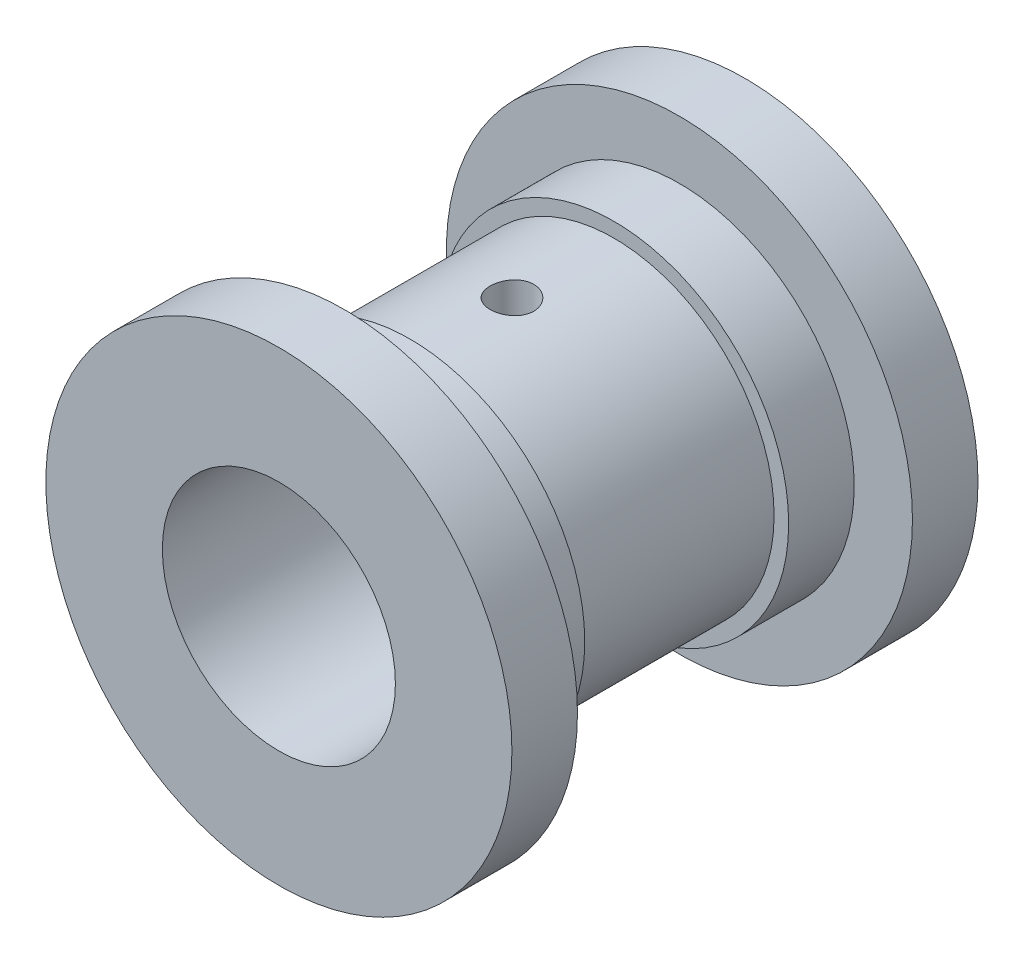
ISO-10303-21;
HEADER;
FILE_DESCRIPTION(('STEP AP214'),'2;1');
FILE_NAME('part.step','',(''),(''),'','','');
FILE_SCHEMA(('AUTOMOTIVE_DESIGN { 1 0 10303 214 1 1 1 1 }'));
ENDSEC;
DATA;
#1=APPLICATION_CONTEXT('core data for automotive mechanical design processes');
#2=APPLICATION_PROTOCOL_DEFINITION('international standard','automotive_design',2000,#1);
#3=PRODUCT_CONTEXT('',#1,'mechanical');
#4=PRODUCT('Part','Part','',(#3));
#5=PRODUCT_RELATED_PRODUCT_CATEGORY('part','',(#4));
#6=PRODUCT_DEFINITION_FORMATION('','',#4);
#7=PRODUCT_DEFINITION_CONTEXT('part definition',#1,'design');
#8=PRODUCT_DEFINITION('design','',#6,#7);
#9=PRODUCT_DEFINITION_SHAPE('','',#8);
#10=(LENGTH_UNIT() NAMED_UNIT(*) SI_UNIT(.MILLI.,.METRE.));
#11=(NAMED_UNIT(*) PLANE_ANGLE_UNIT() SI_UNIT($,.RADIAN.));
#12=(NAMED_UNIT(*) SI_UNIT($,.STERADIAN.) SOLID_ANGLE_UNIT());
#13=UNCERTAINTY_MEASURE_WITH_UNIT(LENGTH_MEASURE(1.E-05),#10,'distance_accuracy_value','');
#14=(GEOMETRIC_REPRESENTATION_CONTEXT(3) GLOBAL_UNCERTAINTY_ASSIGNED_CONTEXT((#13)) GLOBAL_UNIT_ASSIGNED_CONTEXT((#10,
#11,#12)) REPRESENTATION_CONTEXT('',''));
#15=CARTESIAN_POINT('',(0.,0.,0.));
#16=DIRECTION('',(0.,0.,1.));
#17=DIRECTION('',(1.,0.,0.));
#18=AXIS2_PLACEMENT_3D('',#15,#16,#17);
#19=CARTESIAN_POINT('',(0.,0.,14.));
#20=DIRECTION('',(0.,0.,-1.));
#21=DIRECTION('',(-1.,0.,0.));
#22=AXIS2_PLACEMENT_3D('',#19,#20,#21);
#23=CYLINDRICAL_SURFACE('',#22,22.);
#24=CARTESIAN_POINT('',(0.,22.,-3.));
#25=CARTESIAN_POINT('',(0.167676826859721,21.9999974934523,-2.99999296108524));
#26=CARTESIAN_POINT('',(0.335455204579492,21.9980628542975,-2.98589481465488));
#27=CARTESIAN_POINT('',(0.666334195282824,21.990531328169,-2.92988223355143));
#28=CARTESIAN_POINT('',(0.829429891319714,21.984930728802,-2.88793960110033));
#29=CARTESIAN_POINT('',(1.14610618738719,21.9706975479658,-2.77750453231876));
#30=CARTESIAN_POINT('',(1.29969344490645,21.9620671167838,-2.70903092159583));
#31=CARTESIAN_POINT('',(1.59317060489946,21.9427314544459,-2.54752095087958));
#32=CARTESIAN_POINT('',(1.73306265771744,21.9320265498011,-2.45448845549142));
#33=CARTESIAN_POINT('',(1.99611512762449,21.9096571993851,-2.24585557141538));
#34=CARTESIAN_POINT('',(2.11917356924753,21.8979875381044,-2.13012715399307));
#35=CARTESIAN_POINT('',(2.34418667816088,21.8750454311864,-1.87966277841522));
#36=CARTESIAN_POINT('',(2.44614021225599,21.863773006905,-1.74492580027736));
#37=CARTESIAN_POINT('',(2.62643701049846,21.8428507554376,-1.45959612355178));
#38=CARTESIAN_POINT('',(2.70468332936807,21.833207660216,-1.30894162998957));
#39=CARTESIAN_POINT('',(2.83472528970555,21.8167058813552,-0.996476369252653));
#40=CARTESIAN_POINT('',(2.8865221221597,21.8098470723459,-0.834666104780393));
#41=CARTESIAN_POINT('',(2.9618818111018,21.7997409938434,-0.505547512852815));
#42=CARTESIAN_POINT('',(2.98561797729098,21.7964715644898,-0.338279561417878));
#43=CARTESIAN_POINT('',(3.00471910119333,21.7938468760964,-0.00210505395184277));
#44=CARTESIAN_POINT('',(3.00008540995952,21.7944914306616,0.166801423665521));
#45=CARTESIAN_POINT('',(2.9627203403848,21.7996016067311,0.500243451201806));
#46=CARTESIAN_POINT('',(2.9301807783518,21.8040411420393,0.66480095273435));
#47=CARTESIAN_POINT('',(2.83822735390599,21.8162003481636,0.986098081065302));
#48=CARTESIAN_POINT('',(2.77881285300506,21.8239200969101,1.14283752202593));
#49=CARTESIAN_POINT('',(2.63459283520415,21.841799165874,1.44463985207525));
#50=CARTESIAN_POINT('',(2.54970487715522,21.851966385515,1.58966285853603));
#51=CARTESIAN_POINT('',(2.35700646089641,21.8735888866938,1.86347829777156));
#52=CARTESIAN_POINT('',(2.24919475646083,21.8850442382436,1.99226984753348));
#53=CARTESIAN_POINT('',(2.01265055567599,21.908067947796,2.23107910898916));
#54=CARTESIAN_POINT('',(1.88375290146846,21.9196364588217,2.34093328062486));
#55=CARTESIAN_POINT('',(1.60926188881082,21.9414949411558,2.53747298319676));
#56=CARTESIAN_POINT('',(1.46366847832928,21.9517849084796,2.62415844192609));
#57=CARTESIAN_POINT('',(1.1597859389609,21.9699350817542,2.77190372636007));
#58=CARTESIAN_POINT('',(1.00149126426258,21.9777942189694,2.83295228478543));
#59=CARTESIAN_POINT('',(0.676766175879787,21.9901879040614,2.92755567589119));
#60=CARTESIAN_POINT('',(0.510336216560259,21.994722637384,2.96111204218697));
#61=CARTESIAN_POINT('',(0.175477814735345,21.9999322760751,2.99956416913117));
#62=CARTESIAN_POINT('',(0.00707567277568732,22.0006374938028,3.00468501717721));
#63=CARTESIAN_POINT('',(-0.328184588178507,21.9981907754197,2.98671624333853));
#64=CARTESIAN_POINT('',(-0.495042746360837,21.9950389374767,2.96362733943417));
#65=CARTESIAN_POINT('',(-0.821806756729892,21.9852510531583,2.89008155358068));
#66=CARTESIAN_POINT('',(-0.981737441241117,21.9786288024664,2.83973300885735));
#67=CARTESIAN_POINT('',(-1.29088628219117,21.9626408812727,2.71321048193417));
#68=CARTESIAN_POINT('',(-1.44010401285043,21.9532751018062,2.63703547396566));
#69=CARTESIAN_POINT('',(-1.72458978596492,21.9327672607206,2.46048492255194));
#70=CARTESIAN_POINT('',(-1.85976745670649,21.921614741142,2.35996499439926));
#71=CARTESIAN_POINT('',(-2.11141402650921,21.8988110628535,2.1377808440853));
#72=CARTESIAN_POINT('',(-2.22788203490664,21.8871598804385,2.01611561588667));
#73=CARTESIAN_POINT('',(-2.43961065908225,21.8645773754606,1.75409833398319));
#74=CARTESIAN_POINT('',(-2.53472132761283,21.8536515002427,1.61362457303786));
#75=CARTESIAN_POINT('',(-2.69999679098531,21.8338493008832,1.31856338460047));
#76=CARTESIAN_POINT('',(-2.77016216392283,21.8249729292469,1.16397628428285));
#77=CARTESIAN_POINT('',(-2.88331699010305,21.8103129452134,0.845544486653621));
#78=CARTESIAN_POINT('',(-2.92638854100027,21.8045199979441,0.681729411127736));
#79=CARTESIAN_POINT('',(-2.98439621095037,21.7966568632046,0.349106956343931));
#80=CARTESIAN_POINT('',(-2.99933390995801,21.7945864666819,0.180299857971297));
#81=CARTESIAN_POINT('',(-3.00061713169436,21.7944097083055,-0.15602195078192));
#82=CARTESIAN_POINT('',(-2.98719829381274,21.796270677241,-0.323535793216798));
#83=CARTESIAN_POINT('',(-2.93265092877067,21.8036764010729,-0.653902277396974));
#84=CARTESIAN_POINT('',(-2.89152241742378,21.809221153867,-0.816754921802306));
#85=CARTESIAN_POINT('',(-2.7828011290096,21.8233590163958,-1.13313027877028));
#86=CARTESIAN_POINT('',(-2.71522193961382,21.8319505607859,-1.28665773496507));
#87=CARTESIAN_POINT('',(-2.55554079678239,21.85121622249,-1.58023259721272));
#88=CARTESIAN_POINT('',(-2.46343830731648,21.8618903853246,-1.7202797085211));
#89=CARTESIAN_POINT('',(-2.25645830446166,21.884224598437,-1.98412007319957));
#90=CARTESIAN_POINT('',(-2.14140556846805,21.8958918112072,-2.10777527244502));
#91=CARTESIAN_POINT('',(-1.89215973610724,21.9188357460712,-2.33411069342156));
#92=CARTESIAN_POINT('',(-1.7579621639157,21.9301123760831,-2.43678599662273));
#93=CARTESIAN_POINT('',(-1.473530986404,21.9510618593984,-2.61865193476672));
#94=CARTESIAN_POINT('',(-1.32322763703472,21.9607272329125,-2.69773431655265));
#95=CARTESIAN_POINT('',(-1.01141938786063,21.9772907411432,-2.82941896210595));
#96=CARTESIAN_POINT('',(-0.849926624043753,21.9841918205545,-2.8820494193874));
#97=CARTESIAN_POINT('',(-0.573037194174379,21.9928235213462,-2.94702087412789));
#98=CARTESIAN_POINT('',(-0.459371577392146,21.9955012855773,-2.96685872159469));
#99=CARTESIAN_POINT('',(-0.230486627293774,21.9990903781477,-2.99335064196243));
#100=CARTESIAN_POINT('',(-0.1152673085954,22.0000017230944,-3.0000048388127));
#101=CARTESIAN_POINT('',(0.,22.,-3.));
#102=B_SPLINE_CURVE_WITH_KNOTS('',3,(#24,#25,#26,#27,#28,#29,#30,#31,#32,#33,#34,#35,#36,#37,
#38,#39,#40,#41,#42,#43,#44,#45,#46,#47,#48,#49,#50,#51,#52,#53,#54,#55,#56,#57,#58,#59,#60,#61,
#62,#63,#64,#65,#66,#67,#68,#69,#70,#71,#72,#73,#74,#75,#76,#77,#78,#79,#80,#81,#82,#83,#84,#85,
#86,#87,#88,#89,#90,#91,#92,#93,#94,#95,#96,#97,#98,#99,#100,#101),.UNSPECIFIED.,.T.,.F.,(4,2,2,
2,2,2,2,2,2,2,2,2,2,2,2,2,2,2,2,2,2,2,2,2,2,2,2,2,2,2,2,2,2,2,2,2,2,2,4),(0.,0.502609376172301,
1.00572851685898,1.50849131075064,2.0111750366105,2.51678051739006,3.02241313883223,
3.53008635854344,4.03773671636778,4.54223504001235,5.04670933820383,5.54774357745448,
6.04878972077749,6.55147524370068,7.05418810159109,7.56104569493679,8.06790486792019,
8.57498657022924,9.08203998373342,9.58507392409649,10.0880950617602,10.5891315761909,
11.0901879929896,11.5942921539578,12.0984203054351,12.6059843025882,13.1135365364146,
13.619543320099,14.1255216863572,14.6273119749012,15.1291019770798,15.6306345481248,
16.1321780825684,16.6377084708874,17.1433572401882,17.6512916404935,18.1586835098852,
18.5041992012525,18.8497116441535),.UNSPECIFIED.);
#103=CARTESIAN_POINT('',(0.,22.,-3.));
#104=VERTEX_POINT('',#103);
#105=EDGE_CURVE('E155',#104,#104,#102,.T.);
#106=ORIENTED_EDGE('',*,*,#105,.T.);
#107=EDGE_LOOP('',(#106));
#108=FACE_BOUND('',#107,.T.);
#109=CARTESIAN_POINT('',(0.,-22.,4.));
#110=CARTESIAN_POINT('',(0.222714543288746,-21.9999960145572,3.99999136267864));
#111=CARTESIAN_POINT('',(0.445542899836405,-21.9965830546687,3.9813364850347));
#112=CARTESIAN_POINT('',(0.884928813696618,-21.9832969500399,3.90725306795016));
#113=CARTESIAN_POINT('',(1.10148077453215,-21.9734182144508,3.85179270283726));
#114=CARTESIAN_POINT('',(1.52189514502749,-21.9483064647013,3.70584574065803));
#115=CARTESIAN_POINT('',(1.72576852786035,-21.9330781586384,3.61538993562047));
#116=CARTESIAN_POINT('',(2.115424006769,-21.898933429966,3.40210533761642));
#117=CARTESIAN_POINT('',(2.30120773535809,-21.8800173406264,3.27927946962361));
#118=CARTESIAN_POINT('',(2.65152888102477,-21.8403486699966,3.00326818071459));
#119=CARTESIAN_POINT('',(2.81583245206691,-21.8195794519416,2.84978831603848));
#120=CARTESIAN_POINT('',(3.11650714682158,-21.7786699042361,2.51745929182035));
#121=CARTESIAN_POINT('',(3.25287633589955,-21.7585296182252,2.3386083766217));
#122=CARTESIAN_POINT('',(3.49477390032954,-21.7209968041953,1.95897454108045));
#123=CARTESIAN_POINT('',(3.60006626531112,-21.703625742202,1.75803892953925));
#124=CARTESIAN_POINT('',(3.77531093899957,-21.673831665538,1.34096269935207));
#125=CARTESIAN_POINT('',(3.8452661056655,-21.6614082507349,1.12482331194992));
#126=CARTESIAN_POINT('',(3.9471039542263,-21.6430830703341,0.685970701286804));
#127=CARTESIAN_POINT('',(3.97939332850889,-21.6371116924469,0.46335481658075));
#128=CARTESIAN_POINT('',(4.00624497473377,-21.6321566286462,0.0157911853708643));
#129=CARTESIAN_POINT('',(4.00081042593285,-21.633172353881,-0.209156363032063));
#130=CARTESIAN_POINT('',(3.95269868854,-21.6420133009836,-0.652063828266035));
#131=CARTESIAN_POINT('',(3.91048235398144,-21.6497542562853,-0.870075735791443));
#132=CARTESIAN_POINT('',(3.79073046680053,-21.6710412254782,-1.29587003673433));
#133=CARTESIAN_POINT('',(3.71319349486376,-21.6845874726464,-1.50365201870358));
#134=CARTESIAN_POINT('',(3.52454595578591,-21.7160476310543,-1.90444558155747));
#135=CARTESIAN_POINT('',(3.41324780743079,-21.733985834287,-2.09736688533225));
#136=CARTESIAN_POINT('',(3.16037006748085,-21.7721924402343,-2.46196947389059));
#137=CARTESIAN_POINT('',(3.01878758047169,-21.7924610656694,-2.63364872529248));
#138=CARTESIAN_POINT('',(2.70686798836704,-21.8334128161709,-2.95355799288875));
#139=CARTESIAN_POINT('',(2.53613634531379,-21.8540976363293,-3.10140337687383));
#140=CARTESIAN_POINT('',(2.17208908138662,-21.8932750087418,-3.36641026696166));
#141=CARTESIAN_POINT('',(1.97877325899631,-21.9117675414312,-3.48357149924253));
#142=CARTESIAN_POINT('',(1.57465519699459,-21.9445107565068,-3.68393477957005));
#143=CARTESIAN_POINT('',(1.36383356079098,-21.9587566511844,-3.76709853739196));
#144=CARTESIAN_POINT('',(0.930896828925332,-21.9813641094176,-3.89672638498741));
#145=CARTESIAN_POINT('',(0.708782862632129,-21.9897262601819,-3.94319413714782));
#146=CARTESIAN_POINT('',(0.262877299156998,-21.9995438675732,-3.99757952383824));
#147=CARTESIAN_POINT('',(0.0391520242178683,-22.0010937868229,-4.00602444690816));
#148=CARTESIAN_POINT('',(-0.406514477941934,-21.99737260495,-3.98553640363702));
#149=CARTESIAN_POINT('',(-0.628455786906163,-21.9921018181742,-3.95660515985652));
#150=CARTESIAN_POINT('',(-1.06259419518552,-21.975390172649,-3.86262450087624));
#151=CARTESIAN_POINT('',(-1.27485059491664,-21.9639946314432,-3.79784026163435));
#152=CARTESIAN_POINT('',(-1.68548942751322,-21.9363059024444,-3.63427834295612));
#153=CARTESIAN_POINT('',(-1.8838709619219,-21.9200123978487,-3.5354984646046));
#154=CARTESIAN_POINT('',(-2.26339049414987,-21.8840995916968,-3.30557072439415));
#155=CARTESIAN_POINT('',(-2.44432890416976,-21.864447632292,-3.17409862568815));
#156=CARTESIAN_POINT('',(-2.78176427644694,-21.8240857614217,-2.88295924665781));
#157=CARTESIAN_POINT('',(-2.93825909948664,-21.8033757575701,-2.72328950117612));
#158=CARTESIAN_POINT('',(-3.22435475775359,-21.7629207911529,-2.37790623710301));
#159=CARTESIAN_POINT('',(-3.35359673482837,-21.7431910424377,-2.19189338694827));
#160=CARTESIAN_POINT('',(-3.57899973104027,-21.7072302016204,-1.80048763718703));
#161=CARTESIAN_POINT('',(-3.6751619326159,-21.6909989844708,-1.59509543063123));
#162=CARTESIAN_POINT('',(-3.83115890483493,-21.6639908923095,-1.17169850061651));
#163=CARTESIAN_POINT('',(-3.8911621572368,-21.653188760335,-0.953757538523891));
#164=CARTESIAN_POINT('',(-3.97366080357107,-21.6382025309078,-0.510674022737863));
#165=CARTESIAN_POINT('',(-3.99616014907258,-21.6340177362272,-0.285532230302156));
#166=CARTESIAN_POINT('',(-4.00288627326368,-21.6327738776523,0.161970750927272));
#167=CARTESIAN_POINT('',(-3.98767874002465,-21.6356094908823,0.384323342877082));
#168=CARTESIAN_POINT('',(-3.92065693825629,-21.6478541749405,0.823247276034827));
#169=CARTESIAN_POINT('',(-3.86884285811435,-21.6572632119402,1.03981864698857));
#170=CARTESIAN_POINT('',(-3.73031134316953,-21.6815514416183,1.46075239479074));
#171=CARTESIAN_POINT('',(-3.64365162038464,-21.6964215859949,1.66513432044686));
#172=CARTESIAN_POINT('',(-3.43794947329646,-21.7299635502969,2.05654889432947));
#173=CARTESIAN_POINT('',(-3.31890495138014,-21.7486356164588,2.24358041769117));
#174=CARTESIAN_POINT('',(-3.04983087325598,-21.7880064930293,2.59782574919125));
#175=CARTESIAN_POINT('',(-2.89938831106199,-21.8087301566221,2.76472313974153));
#176=CARTESIAN_POINT('',(-2.57265302846728,-21.849679841373,3.07109416202438));
#177=CARTESIAN_POINT('',(-2.39635437360186,-21.8699057470383,3.21056148078449));
#178=CARTESIAN_POINT('',(-2.0211423792926,-21.9077794859438,3.45920059424698));
#179=CARTESIAN_POINT('',(-1.82205169958099,-21.9254042634686,3.56810837036026));
#180=CARTESIAN_POINT('',(-1.40814781017269,-21.9558652198669,3.75075843214811));
#181=CARTESIAN_POINT('',(-1.19334985097334,-21.9687059716947,3.82453431855663));
#182=CARTESIAN_POINT('',(-0.814883498916811,-21.9854814075298,3.91955086060438));
#183=CARTESIAN_POINT('',(-0.65345085455298,-21.9908956054717,3.9496686659207));
#184=CARTESIAN_POINT('',(-0.328032684264407,-21.9981563286609,3.9898961875898));
#185=CARTESIAN_POINT('',(-0.164047216881666,-22.0000029356,4.00000636208354));
#186=CARTESIAN_POINT('',(0.,-22.,4.));
#187=B_SPLINE_CURVE_WITH_KNOTS('',3,(#109,#110,#111,#112,#113,#114,#115,#116,#117,#118,#119,
#120,#121,#122,#123,#124,#125,#126,#127,#128,#129,#130,#131,#132,#133,#134,#135,#136,#137,#138,
#139,#140,#141,#142,#143,#144,#145,#146,#147,#148,#149,#150,#151,#152,#153,#154,#155,#156,#157,
#158,#159,#160,#161,#162,#163,#164,#165,#166,#167,#168,#169,#170,#171,#172,#173,#174,#175,#176,
#177,#178,#179,#180,#181,#182,#183,#184,#185,#186),.UNSPECIFIED.,.T.,.F.,(4,2,2,2,2,2,2,2,2,2,2,
2,2,2,2,2,2,2,2,2,2,2,2,2,2,2,2,2,2,2,2,2,2,2,2,2,2,2,4),(0.,0.667543783104664,1.33566554414518,
2.00320076573349,2.670675689203,3.3449002919377,4.01917157326156,4.698439044073,
5.37765156911461,6.0494604234529,6.72121266048405,7.3846673458179,8.04814869357741,
8.7153861292325,9.3826873864251,10.0598642088374,10.7370470740929,11.4149905404762,
12.0928663372291,12.7613120199473,13.4297268970159,14.0932628657086,14.7568417614844,
15.4272845359133,16.0977859523225,16.7766301226092,17.4554500250495,18.1310820215231,
18.806642826072,19.4721301946074,20.1376141383862,20.8020004051792,21.4664297155381,
22.1402222906008,22.8141697565893,23.4937720908585,24.1727231299633,24.6644342045912,
25.1561340197353),.UNSPECIFIED.);
#188=CARTESIAN_POINT('',(0.,-22.,4.));
#189=VERTEX_POINT('',#188);
#190=EDGE_CURVE('E61',#189,#189,#187,.T.);
#191=ORIENTED_EDGE('',*,*,#190,.T.);
#192=EDGE_LOOP('',(#191));
#193=FACE_BOUND('',#192,.T.);
#194=CARTESIAN_POINT('',(0.,0.,14.));
#195=DIRECTION('',(0.,0.,1.));
#196=DIRECTION('',(1.,0.,0.));
#197=AXIS2_PLACEMENT_3D('',#194,#195,#196);
#198=CIRCLE('',#197,22.);
#199=CARTESIAN_POINT('',(22.,0.,14.));
#200=VERTEX_POINT('',#199);
#201=EDGE_CURVE('E10',#200,#200,#198,.T.);
#202=ORIENTED_EDGE('',*,*,#201,.F.);
#203=EDGE_LOOP('',(#202));
#204=FACE_BOUND('',#203,.T.);
#205=CARTESIAN_POINT('',(0.,0.,-14.));
#206=DIRECTION('',(0.,0.,1.));
#207=DIRECTION('',(1.,0.,0.));
#208=AXIS2_PLACEMENT_3D('',#205,#206,#207);
#209=CIRCLE('',#208,22.);
#210=CARTESIAN_POINT('',(22.,0.,-14.));
#211=VERTEX_POINT('',#210);
#212=EDGE_CURVE('E57',#211,#211,#209,.T.);
#213=ORIENTED_EDGE('',*,*,#212,.T.);
#214=EDGE_LOOP('',(#213));
#215=FACE_BOUND('',#214,.T.);
#216=ADVANCED_FACE('F35',(#108,#193,#204,#215),#23,.T.);
#217=CARTESIAN_POINT('',(0.,0.,23.));
#218=DIRECTION('',(0.,0.,-1.));
#219=DIRECTION('',(-1.,0.,0.));
#220=AXIS2_PLACEMENT_3D('',#217,#218,#219);
#221=CYLINDRICAL_SURFACE('',#220,24.);
#222=CARTESIAN_POINT('',(0.,0.,23.));
#223=DIRECTION('',(0.,0.,1.));
#224=DIRECTION('',(1.,0.,0.));
#225=AXIS2_PLACEMENT_3D('',#222,#223,#224);
#226=CIRCLE('',#225,24.);
#227=CARTESIAN_POINT('',(24.,0.,23.));
#228=VERTEX_POINT('',#227);
#229=EDGE_CURVE('E48',#228,#228,#226,.T.);
#230=ORIENTED_EDGE('',*,*,#229,.F.);
#231=EDGE_LOOP('',(#230));
#232=FACE_BOUND('',#231,.T.);
#233=CARTESIAN_POINT('',(0.,0.,14.));
#234=DIRECTION('',(0.,0.,1.));
#235=DIRECTION('',(1.,0.,0.));
#236=AXIS2_PLACEMENT_3D('',#233,#234,#235);
#237=CIRCLE('',#236,24.);
#238=CARTESIAN_POINT('',(24.,0.,14.));
#239=VERTEX_POINT('',#238);
#240=EDGE_CURVE('E53',#239,#239,#237,.T.);
#241=ORIENTED_EDGE('',*,*,#240,.T.);
#242=EDGE_LOOP('',(#241));
#243=FACE_BOUND('',#242,.T.);
#244=ADVANCED_FACE('F114',(#232,#243),#221,.T.);
#245=CARTESIAN_POINT('',(0.,0.,14.));
#246=DIRECTION('',(0.,0.,1.));
#247=DIRECTION('',(1.,0.,0.));
#248=AXIS2_PLACEMENT_3D('',#245,#246,#247);
#249=PLANE('',#248);
#250=ORIENTED_EDGE('',*,*,#201,.T.);
#251=EDGE_LOOP('',(#250));
#252=FACE_BOUND('',#251,.T.);
#253=ORIENTED_EDGE('',*,*,#240,.F.);
#254=EDGE_LOOP('',(#253));
#255=FACE_BOUND('',#254,.T.);
#256=ADVANCED_FACE('F111',(#252,#255),#249,.F.);
#257=CARTESIAN_POINT('',(0.,0.,-23.));
#258=DIRECTION('',(0.,0.,1.));
#259=DIRECTION('',(1.,0.,0.));
#260=AXIS2_PLACEMENT_3D('',#257,#258,#259);
#261=CYLINDRICAL_SURFACE('',#260,24.);
#262=CARTESIAN_POINT('',(0.,0.,-23.));
#263=DIRECTION('',(0.,0.,1.));
#264=DIRECTION('',(1.,0.,0.));
#265=AXIS2_PLACEMENT_3D('',#262,#263,#264);
#266=CIRCLE('',#265,24.);
#267=CARTESIAN_POINT('',(24.,0.,-23.));
#268=VERTEX_POINT('',#267);
#269=EDGE_CURVE('E132',#268,#268,#266,.T.);
#270=ORIENTED_EDGE('',*,*,#269,.T.);
#271=EDGE_LOOP('',(#270));
#272=FACE_BOUND('',#271,.T.);
#273=CARTESIAN_POINT('',(0.,0.,-14.));
#274=DIRECTION('',(0.,0.,1.));
#275=DIRECTION('',(1.,0.,0.));
#276=AXIS2_PLACEMENT_3D('',#273,#274,#275);
#277=CIRCLE('',#276,24.);
#278=CARTESIAN_POINT('',(24.,0.,-14.));
#279=VERTEX_POINT('',#278);
#280=EDGE_CURVE('E60',#279,#279,#277,.T.);
#281=ORIENTED_EDGE('',*,*,#280,.F.);
#282=EDGE_LOOP('',(#281));
#283=FACE_BOUND('',#282,.T.);
#284=ADVANCED_FACE('F107',(#272,#283),#261,.T.);
#285=CARTESIAN_POINT('',(0.,0.,-14.));
#286=DIRECTION('',(0.,0.,-1.));
#287=DIRECTION('',(1.,0.,0.));
#288=AXIS2_PLACEMENT_3D('',#285,#286,#287);
#289=PLANE('',#288);
#290=ORIENTED_EDGE('',*,*,#212,.F.);
#291=EDGE_LOOP('',(#290));
#292=FACE_BOUND('',#291,.T.);
#293=ORIENTED_EDGE('',*,*,#280,.T.);
#294=EDGE_LOOP('',(#293));
#295=FACE_BOUND('',#294,.T.);
#296=ADVANCED_FACE('F103',(#292,#295),#289,.F.);
#297=CARTESIAN_POINT('',(0.,0.,32.));
#298=DIRECTION('',(0.,0.,-1.));
#299=DIRECTION('',(-1.,0.,0.));
#300=AXIS2_PLACEMENT_3D('',#297,#298,#299);
#301=CYLINDRICAL_SURFACE('',#300,32.);
#302=CARTESIAN_POINT('',(0.,0.,32.));
#303=DIRECTION('',(0.,0.,1.));
#304=DIRECTION('',(1.,0.,0.));
#305=AXIS2_PLACEMENT_3D('',#302,#303,#304);
#306=CIRCLE('',#305,32.);
#307=CARTESIAN_POINT('',(32.,0.,32.));
#308=VERTEX_POINT('',#307);
#309=EDGE_CURVE('E131',#308,#308,#306,.T.);
#310=ORIENTED_EDGE('',*,*,#309,.F.);
#311=EDGE_LOOP('',(#310));
#312=FACE_BOUND('',#311,.T.);
#313=CARTESIAN_POINT('',(0.,0.,23.));
#314=DIRECTION('',(0.,0.,1.));
#315=DIRECTION('',(1.,0.,0.));
#316=AXIS2_PLACEMENT_3D('',#313,#314,#315);
#317=CIRCLE('',#316,32.);
#318=CARTESIAN_POINT('',(32.,0.,23.));
#319=VERTEX_POINT('',#318);
#320=EDGE_CURVE('E129',#319,#319,#317,.T.);
#321=ORIENTED_EDGE('',*,*,#320,.T.);
#322=EDGE_LOOP('',(#321));
#323=FACE_BOUND('',#322,.T.);
#324=ADVANCED_FACE('F96',(#312,#323),#301,.T.);
#325=CARTESIAN_POINT('',(0.,0.,32.));
#326=DIRECTION('',(0.,0.,1.));
#327=DIRECTION('',(1.,0.,0.));
#328=AXIS2_PLACEMENT_3D('',#325,#326,#327);
#329=PLANE('',#328);
#330=CARTESIAN_POINT('',(0.,0.,32.));
#331=DIRECTION('',(0.,0.,1.));
#332=DIRECTION('',(1.,0.,0.));
#333=AXIS2_PLACEMENT_3D('',#330,#331,#332);
#334=CIRCLE('',#333,16.);
#335=CARTESIAN_POINT('',(16.,0.,32.));
#336=VERTEX_POINT('',#335);
#337=EDGE_CURVE('E151',#336,#336,#334,.T.);
#338=ORIENTED_EDGE('',*,*,#337,.F.);
#339=EDGE_LOOP('',(#338));
#340=FACE_BOUND('',#339,.T.);
#341=ORIENTED_EDGE('',*,*,#309,.T.);
#342=EDGE_LOOP('',(#341));
#343=FACE_BOUND('',#342,.T.);
#344=ADVANCED_FACE('F93',(#340,#343),#329,.T.);
#345=CARTESIAN_POINT('',(0.,0.,23.));
#346=DIRECTION('',(0.,0.,1.));
#347=DIRECTION('',(1.,0.,0.));
#348=AXIS2_PLACEMENT_3D('',#345,#346,#347);
#349=PLANE('',#348);
#350=ORIENTED_EDGE('',*,*,#229,.T.);
#351=EDGE_LOOP('',(#350));
#352=FACE_BOUND('',#351,.T.);
#353=ORIENTED_EDGE('',*,*,#320,.F.);
#354=EDGE_LOOP('',(#353));
#355=FACE_BOUND('',#354,.T.);
#356=ADVANCED_FACE('F91',(#352,#355),#349,.F.);
#357=CARTESIAN_POINT('',(0.,0.,-32.));
#358=DIRECTION('',(0.,0.,1.));
#359=DIRECTION('',(1.,0.,0.));
#360=AXIS2_PLACEMENT_3D('',#357,#358,#359);
#361=CYLINDRICAL_SURFACE('',#360,32.);
#362=CARTESIAN_POINT('',(0.,0.,-32.));
#363=DIRECTION('',(0.,0.,1.));
#364=DIRECTION('',(1.,0.,0.));
#365=AXIS2_PLACEMENT_3D('',#362,#363,#364);
#366=CIRCLE('',#365,32.);
#367=CARTESIAN_POINT('',(32.,0.,-32.));
#368=VERTEX_POINT('',#367);
#369=EDGE_CURVE('E137',#368,#368,#366,.T.);
#370=ORIENTED_EDGE('',*,*,#369,.T.);
#371=EDGE_LOOP('',(#370));
#372=FACE_BOUND('',#371,.T.);
#373=CARTESIAN_POINT('',(0.,0.,-23.));
#374=DIRECTION('',(0.,0.,1.));
#375=DIRECTION('',(1.,0.,0.));
#376=AXIS2_PLACEMENT_3D('',#373,#374,#375);
#377=CIRCLE('',#376,32.);
#378=CARTESIAN_POINT('',(32.,0.,-23.));
#379=VERTEX_POINT('',#378);
#380=EDGE_CURVE('E67',#379,#379,#377,.T.);
#381=ORIENTED_EDGE('',*,*,#380,.F.);
#382=EDGE_LOOP('',(#381));
#383=FACE_BOUND('',#382,.T.);
#384=ADVANCED_FACE('F84',(#372,#383),#361,.T.);
#385=CARTESIAN_POINT('',(0.,0.,-32.));
#386=DIRECTION('',(0.,0.,-1.));
#387=DIRECTION('',(1.,0.,0.));
#388=AXIS2_PLACEMENT_3D('',#385,#386,#387);
#389=PLANE('',#388);
#390=CARTESIAN_POINT('',(0.,0.,-32.));
#391=DIRECTION('',(0.,0.,-1.));
#392=DIRECTION('',(-1.,0.,0.));
#393=AXIS2_PLACEMENT_3D('',#390,#391,#392);
#394=CIRCLE('',#393,16.);
#395=CARTESIAN_POINT('',(-16.,0.,-32.));
#396=VERTEX_POINT('',#395);
#397=EDGE_CURVE('E152',#396,#396,#394,.F.);
#398=ORIENTED_EDGE('',*,*,#397,.T.);
#399=EDGE_LOOP('',(#398));
#400=FACE_BOUND('',#399,.T.);
#401=ORIENTED_EDGE('',*,*,#369,.F.);
#402=EDGE_LOOP('',(#401));
#403=FACE_BOUND('',#402,.T.);
#404=ADVANCED_FACE('F81',(#400,#403),#389,.T.);
#405=CARTESIAN_POINT('',(0.,0.,-23.));
#406=DIRECTION('',(0.,0.,-1.));
#407=DIRECTION('',(1.,0.,0.));
#408=AXIS2_PLACEMENT_3D('',#405,#406,#407);
#409=PLANE('',#408);
#410=ORIENTED_EDGE('',*,*,#269,.F.);
#411=EDGE_LOOP('',(#410));
#412=FACE_BOUND('',#411,.T.);
#413=ORIENTED_EDGE('',*,*,#380,.T.);
#414=EDGE_LOOP('',(#413));
#415=FACE_BOUND('',#414,.T.);
#416=ADVANCED_FACE('F79',(#412,#415),#409,.F.);
#417=CARTESIAN_POINT('',(0.,-30.,0.));
#418=DIRECTION('',(0.,1.,0.));
#419=DIRECTION('',(0.,0.,1.));
#420=AXIS2_PLACEMENT_3D('',#417,#418,#419);
#421=CYLINDRICAL_SURFACE('',#420,4.);
#422=CARTESIAN_POINT('',(0.,-30.,0.));
#423=DIRECTION('',(0.,1.,0.));
#424=DIRECTION('',(0.,0.,1.));
#425=AXIS2_PLACEMENT_3D('',#422,#423,#424);
#426=CIRCLE('',#425,4.);
#427=CARTESIAN_POINT('',(0.,-30.,4.));
#428=VERTEX_POINT('',#427);
#429=EDGE_CURVE('E68',#428,#428,#426,.T.);
#430=ORIENTED_EDGE('',*,*,#429,.T.);
#431=EDGE_LOOP('',(#430));
#432=FACE_BOUND('',#431,.T.);
#433=ORIENTED_EDGE('',*,*,#190,.F.);
#434=EDGE_LOOP('',(#433));
#435=FACE_BOUND('',#434,.T.);
#436=ADVANCED_FACE('F73',(#432,#435),#421,.T.);
#437=CARTESIAN_POINT('',(0.,-30.,0.));
#438=DIRECTION('',(0.,1.,0.));
#439=DIRECTION('',(0.,0.,1.));
#440=AXIS2_PLACEMENT_3D('',#437,#438,#439);
#441=PLANE('',#440);
#442=CARTESIAN_POINT('',(0.,-30.,0.));
#443=DIRECTION('',(0.,-1.,0.));
#444=DIRECTION('',(0.,0.,-1.));
#445=AXIS2_PLACEMENT_3D('',#442,#443,#444);
#446=CIRCLE('',#445,3.);
#447=CARTESIAN_POINT('',(0.,-30.,-3.));
#448=VERTEX_POINT('',#447);
#449=EDGE_CURVE('E163',#448,#448,#446,.T.);
#450=ORIENTED_EDGE('',*,*,#449,.F.);
#451=EDGE_LOOP('',(#450));
#452=FACE_BOUND('',#451,.T.);
#453=ORIENTED_EDGE('',*,*,#429,.F.);
#454=EDGE_LOOP('',(#453));
#455=FACE_BOUND('',#454,.T.);
#456=ADVANCED_FACE('F78',(#452,#455),#441,.F.);
#457=CARTESIAN_POINT('',(0.,0.,-32.001));
#458=DIRECTION('',(0.,0.,1.));
#459=DIRECTION('',(1.,0.,0.));
#460=AXIS2_PLACEMENT_3D('',#457,#458,#459);
#461=CYLINDRICAL_SURFACE('',#460,16.);
#462=CARTESIAN_POINT('',(0.,16.,-3.));
#463=CARTESIAN_POINT('',(-0.166943492930942,15.999996976677,-2.99999362082345));
#464=CARTESIAN_POINT('',(-0.333969985460197,15.9973601984343,-2.98601784676124));
#465=CARTESIAN_POINT('',(-0.663316259683595,15.9870957178104,-2.93052000976331));
#466=CARTESIAN_POINT('',(-0.825631948304451,15.9794638033379,-2.88897469872053));
#467=CARTESIAN_POINT('',(-1.1407459237036,15.9600627753092,-2.77965459748132));
#468=CARTESIAN_POINT('',(-1.29355266137069,15.9482973989297,-2.71190349509491));
#469=CARTESIAN_POINT('',(-1.58561594618801,15.9219142119957,-2.55216224615437));
#470=CARTESIAN_POINT('',(-1.72487358895465,15.9072966323658,-2.46017406171036));
#471=CARTESIAN_POINT('',(-1.98756743186101,15.8766267286101,-2.25340046399265));
#472=CARTESIAN_POINT('',(-2.11081791006367,15.860560697127,-2.13838111065973));
#473=CARTESIAN_POINT('',(-2.33639212270739,15.828906369173,-1.88931338182488));
#474=CARTESIAN_POINT('',(-2.43871435378483,15.8133181070905,-1.75526364046143));
#475=CARTESIAN_POINT('',(-2.62029997331586,15.7842510249001,-1.47062782327206));
#476=CARTESIAN_POINT('',(-2.69937443939211,15.7707898777236,-1.31991925936553));
#477=CARTESIAN_POINT('',(-2.83101048664566,15.7476942642397,-1.00706216964642));
#478=CARTESIAN_POINT('',(-2.88357435426196,15.7380594679392,-0.844914631777565));
#479=CARTESIAN_POINT('',(-2.96010107007,15.723845391491,-0.515769538171176));
#480=CARTESIAN_POINT('',(-2.98438780384078,15.7192089073281,-0.34884980559307));
#481=CARTESIAN_POINT('',(-3.00467616190693,15.7153439430552,-0.0132452303835027));
#482=CARTESIAN_POINT('',(-3.00068032270748,15.7161149779752,0.155439452604605));
#483=CARTESIAN_POINT('',(-2.96477959204725,15.7229258540351,0.487439050532094));
#484=CARTESIAN_POINT('',(-2.9332429999209,15.7288961629467,0.650795428600309));
#485=CARTESIAN_POINT('',(-2.84373598792414,15.7453236656933,0.969856839565218));
#486=CARTESIAN_POINT('',(-2.78576444478999,15.7557810501903,1.1255615470186));
#487=CARTESIAN_POINT('',(-2.644672943586,15.7800771058518,1.42597735800053));
#488=CARTESIAN_POINT('',(-2.56140427064911,15.7939356764673,1.57061694116162));
#489=CARTESIAN_POINT('',(-2.37218737860832,15.8234594320584,1.84400945708047));
#490=CARTESIAN_POINT('',(-2.26623685778532,15.8391248003104,1.9727607754296));
#491=CARTESIAN_POINT('',(-2.03267811370595,15.8708000254433,2.21284991134492));
#492=CARTESIAN_POINT('',(-1.90475487372136,15.8868114204806,2.32388130490348));
#493=CARTESIAN_POINT('',(-1.63193607419765,15.9171477221664,2.52295448135081));
#494=CARTESIAN_POINT('',(-1.48704034451154,15.9314726119049,2.61099603374084));
#495=CARTESIAN_POINT('',(-1.18406997774933,15.9568507935502,2.76163550774004));
#496=CARTESIAN_POINT('',(-1.02597912889298,15.9678999827258,2.82420155823579));
#497=CARTESIAN_POINT('',(-0.701278230797391,15.9854501080544,2.92180418618432));
#498=CARTESIAN_POINT('',(-0.534669088555572,15.9919515273599,2.95684368809071));
#499=CARTESIAN_POINT('',(-0.200297305806768,15.9996072128396,2.99797206203654));
#500=CARTESIAN_POINT('',(-0.0325880252682691,16.0008390182456,3.00448078305945));
#501=CARTESIAN_POINT('',(0.301522496184369,15.9980308719646,2.9894890409047));
#502=CARTESIAN_POINT('',(0.467923800960772,15.9939911792886,2.96798995386948));
#503=CARTESIAN_POINT('',(0.793363146436436,15.9811422300081,2.89794192963326));
#504=CARTESIAN_POINT('',(0.952448522092128,15.9723704474806,2.84960543492437));
#505=CARTESIAN_POINT('',(1.26025726364927,15.95103684425,2.72748458644243));
#506=CARTESIAN_POINT('',(1.40897992519021,15.9384747662267,2.65369850486843));
#507=CARTESIAN_POINT('',(1.69363334302643,15.9107606071533,2.48184374368097));
#508=CARTESIAN_POINT('',(1.82940655403024,15.8955817234913,2.38351852292632));
#509=CARTESIAN_POINT('',(2.08267664652909,15.8643868697942,2.16572372527528));
#510=CARTESIAN_POINT('',(2.20017181952173,15.8483708216937,2.04625217399734));
#511=CARTESIAN_POINT('',(2.41514591744096,15.817049513949,1.78765536217715));
#512=CARTESIAN_POINT('',(2.51233832437153,15.8017565172051,1.64829018374923));
#513=CARTESIAN_POINT('',(2.68193350115574,15.7738597115706,1.3549647509525));
#514=CARTESIAN_POINT('',(2.75433719227848,15.761255802747,1.20100503925905));
#515=CARTESIAN_POINT('',(2.87189347025646,15.7402604841915,0.883588265514926));
#516=CARTESIAN_POINT('',(2.91717737589572,15.7318488087376,0.720181240881333));
#517=CARTESIAN_POINT('',(2.97961358652471,15.7201440760483,0.387905554957195));
#518=CARTESIAN_POINT('',(2.99676906541416,15.7168504413158,0.219037512059196));
#519=CARTESIAN_POINT('',(3.00235524296709,15.7157839960771,-0.116496662883027));
#520=CARTESIAN_POINT('',(2.99123790006998,15.7179243194859,-0.283155161913992));
#521=CARTESIAN_POINT('',(2.94158350757606,15.7272920132,-0.612182844090577));
#522=CARTESIAN_POINT('',(2.90304662178664,15.7345193531149,-0.774552052854882));
#523=CARTESIAN_POINT('',(2.79983775166526,15.7532101604636,-1.09014896959096));
#524=CARTESIAN_POINT('',(2.73521470794505,15.7646656918993,-1.24339318269154));
#525=CARTESIAN_POINT('',(2.58171737824408,15.7905277510368,-1.53693650848169));
#526=CARTESIAN_POINT('',(2.49284137896371,15.8049344872024,-1.67723470568956));
#527=CARTESIAN_POINT('',(2.2917897467907,15.8353453221549,-1.94316736008459));
#528=CARTESIAN_POINT('',(2.17928519728607,15.8513701070609,-2.06855082513421));
#529=CARTESIAN_POINT('',(1.93485585348458,15.8830566783747,-2.29881032492905));
#530=CARTESIAN_POINT('',(1.80292660378323,15.8987183805466,-2.40368164196027));
#531=CARTESIAN_POINT('',(1.52196989014374,15.928079519361,-2.59082190525412));
#532=CARTESIAN_POINT('',(1.37279918128103,15.9417600198112,-2.67287885698128));
#533=CARTESIAN_POINT('',(1.06258022730767,15.9654323876137,-2.81063527321027));
#534=CARTESIAN_POINT('',(0.901543303410494,15.9754277175807,-2.86635949409382));
#535=CARTESIAN_POINT('',(0.616694405650306,15.9885658141526,-2.93855462883735));
#536=CARTESIAN_POINT('',(0.49454762050374,15.9928294175641,-2.9615572606256));
#537=CARTESIAN_POINT('',(0.248282494230315,15.9985475990802,-2.99228212423289));
#538=CARTESIAN_POINT('',(0.124164203305419,16.0000022485961,-3.00000474451181));
#539=CARTESIAN_POINT('',(0.,16.,-3.));
#540=B_SPLINE_CURVE_WITH_KNOTS('',3,(#462,#463,#464,#465,#466,#467,#468,#469,#470,#471,#472,
#473,#474,#475,#476,#477,#478,#479,#480,#481,#482,#483,#484,#485,#486,#487,#488,#489,#490,#491,
#492,#493,#494,#495,#496,#497,#498,#499,#500,#501,#502,#503,#504,#505,#506,#507,#508,#509,#510,
#511,#512,#513,#514,#515,#516,#517,#518,#519,#520,#521,#522,#523,#524,#525,#526,#527,#528,#529,
#530,#531,#532,#533,#534,#535,#536,#537,#538,#539),.UNSPECIFIED.,.T.,.F.,(4,2,2,2,2,2,2,2,2,2,2,
2,2,2,2,2,2,2,2,2,2,2,2,2,2,2,2,2,2,2,2,2,2,2,2,2,2,2,4),(0.,0.500376401929848,1.0011752850709,
1.50152254246181,2.00182930673782,2.50750236027261,3.01321172567233,3.52292381008715,
4.03259192623897,4.53636302890672,5.04008895174512,5.53718001225531,6.03429219693573,
6.53438525259061,7.03452908099719,7.54255536928154,8.05058675089895,8.55925176643398,
9.06786273347491,9.56896348152193,10.0700396092917,10.5672046781566,11.0644035067606,
11.5670355603542,12.069714568262,12.579068739746,13.0884039790989,13.5952525563712,
14.1020439389303,14.600785044635,15.0995231708301,15.5973299241539,16.0951718531085,
16.6004673993276,17.1058790252451,17.6158409783263,18.1253225386235,18.4974868904882,
18.8696417807908),.UNSPECIFIED.);
#541=CARTESIAN_POINT('',(0.,16.,-3.));
#542=VERTEX_POINT('',#541);
#543=EDGE_CURVE('E39',#542,#542,#540,.T.);
#544=ORIENTED_EDGE('',*,*,#543,.T.);
#545=EDGE_LOOP('',(#544));
#546=FACE_BOUND('',#545,.T.);
#547=CARTESIAN_POINT('',(0.,-16.,-3.));
#548=CARTESIAN_POINT('',(0.166943492930942,-15.999996976677,-2.99999362082345));
#549=CARTESIAN_POINT('',(0.333969985460197,-15.9973601984343,-2.98601784676124));
#550=CARTESIAN_POINT('',(0.663316259683595,-15.9870957178104,-2.93052000976331));
#551=CARTESIAN_POINT('',(0.825631948304451,-15.9794638033379,-2.88897469872053));
#552=CARTESIAN_POINT('',(1.1407459237036,-15.9600627753092,-2.77965459748132));
#553=CARTESIAN_POINT('',(1.29355266137069,-15.9482973989297,-2.71190349509491));
#554=CARTESIAN_POINT('',(1.58561594618801,-15.9219142119957,-2.55216224615437));
#555=CARTESIAN_POINT('',(1.72487358895465,-15.9072966323658,-2.46017406171036));
#556=CARTESIAN_POINT('',(1.98756743186101,-15.8766267286101,-2.25340046399265));
#557=CARTESIAN_POINT('',(2.11081791006367,-15.860560697127,-2.13838111065973));
#558=CARTESIAN_POINT('',(2.33639212270739,-15.828906369173,-1.88931338182488));
#559=CARTESIAN_POINT('',(2.43871435378483,-15.8133181070905,-1.75526364046143));
#560=CARTESIAN_POINT('',(2.62029997331586,-15.7842510249001,-1.47062782327206));
#561=CARTESIAN_POINT('',(2.69937443939211,-15.7707898777236,-1.31991925936553));
#562=CARTESIAN_POINT('',(2.83101048664566,-15.7476942642397,-1.00706216964642));
#563=CARTESIAN_POINT('',(2.88357435426196,-15.7380594679392,-0.844914631777565));
#564=CARTESIAN_POINT('',(2.96010107007,-15.723845391491,-0.515769538171176));
#565=CARTESIAN_POINT('',(2.98438780384078,-15.7192089073281,-0.34884980559307));
#566=CARTESIAN_POINT('',(3.00467616190693,-15.7153439430552,-0.0132452303835027));
#567=CARTESIAN_POINT('',(3.00068032270748,-15.7161149779752,0.155439452604605));
#568=CARTESIAN_POINT('',(2.96477959204725,-15.7229258540351,0.487439050532094));
#569=CARTESIAN_POINT('',(2.9332429999209,-15.7288961629467,0.650795428600309));
#570=CARTESIAN_POINT('',(2.84373598792414,-15.7453236656933,0.969856839565218));
#571=CARTESIAN_POINT('',(2.78576444478999,-15.7557810501903,1.1255615470186));
#572=CARTESIAN_POINT('',(2.644672943586,-15.7800771058518,1.42597735800053));
#573=CARTESIAN_POINT('',(2.56140427064911,-15.7939356764673,1.57061694116162));
#574=CARTESIAN_POINT('',(2.37218737860832,-15.8234594320584,1.84400945708047));
#575=CARTESIAN_POINT('',(2.26623685778532,-15.8391248003104,1.9727607754296));
#576=CARTESIAN_POINT('',(2.03267811370595,-15.8708000254433,2.21284991134492));
#577=CARTESIAN_POINT('',(1.90475487372136,-15.8868114204806,2.32388130490348));
#578=CARTESIAN_POINT('',(1.63193607419765,-15.9171477221664,2.52295448135081));
#579=CARTESIAN_POINT('',(1.48704034451154,-15.9314726119049,2.61099603374084));
#580=CARTESIAN_POINT('',(1.18406997774933,-15.9568507935502,2.76163550774004));
#581=CARTESIAN_POINT('',(1.02597912889298,-15.9678999827258,2.82420155823579));
#582=CARTESIAN_POINT('',(0.701278230797391,-15.9854501080544,2.92180418618432));
#583=CARTESIAN_POINT('',(0.534669088555572,-15.9919515273599,2.95684368809071));
#584=CARTESIAN_POINT('',(0.200297305806768,-15.9996072128396,2.99797206203654));
#585=CARTESIAN_POINT('',(0.0325880252682691,-16.0008390182456,3.00448078305945));
#586=CARTESIAN_POINT('',(-0.301522496184369,-15.9980308719646,2.9894890409047));
#587=CARTESIAN_POINT('',(-0.467923800960772,-15.9939911792886,2.96798995386948));
#588=CARTESIAN_POINT('',(-0.793363146436436,-15.9811422300081,2.89794192963326));
#589=CARTESIAN_POINT('',(-0.952448522092128,-15.9723704474806,2.84960543492437));
#590=CARTESIAN_POINT('',(-1.26025726364927,-15.95103684425,2.72748458644243));
#591=CARTESIAN_POINT('',(-1.40897992519021,-15.9384747662267,2.65369850486843));
#592=CARTESIAN_POINT('',(-1.69363334302643,-15.9107606071533,2.48184374368097));
#593=CARTESIAN_POINT('',(-1.82940655403024,-15.8955817234913,2.38351852292632));
#594=CARTESIAN_POINT('',(-2.08267664652909,-15.8643868697942,2.16572372527528));
#595=CARTESIAN_POINT('',(-2.20017181952173,-15.8483708216937,2.04625217399734));
#596=CARTESIAN_POINT('',(-2.41514591744096,-15.817049513949,1.78765536217715));
#597=CARTESIAN_POINT('',(-2.51233832437153,-15.8017565172051,1.64829018374923));
#598=CARTESIAN_POINT('',(-2.68193350115574,-15.7738597115706,1.3549647509525));
#599=CARTESIAN_POINT('',(-2.75433719227848,-15.761255802747,1.20100503925905));
#600=CARTESIAN_POINT('',(-2.87189347025646,-15.7402604841915,0.883588265514926));
#601=CARTESIAN_POINT('',(-2.91717737589572,-15.7318488087376,0.720181240881333));
#602=CARTESIAN_POINT('',(-2.97961358652471,-15.7201440760483,0.387905554957195));
#603=CARTESIAN_POINT('',(-2.99676906541416,-15.7168504413158,0.219037512059196));
#604=CARTESIAN_POINT('',(-3.00235524296709,-15.7157839960771,-0.116496662883027));
#605=CARTESIAN_POINT('',(-2.99123790006998,-15.7179243194859,-0.283155161913992));
#606=CARTESIAN_POINT('',(-2.94158350757606,-15.7272920132,-0.612182844090577));
#607=CARTESIAN_POINT('',(-2.90304662178664,-15.7345193531149,-0.774552052854882));
#608=CARTESIAN_POINT('',(-2.79983775166526,-15.7532101604636,-1.09014896959096));
#609=CARTESIAN_POINT('',(-2.73521470794505,-15.7646656918993,-1.24339318269154));
#610=CARTESIAN_POINT('',(-2.58171737824408,-15.7905277510368,-1.53693650848169));
#611=CARTESIAN_POINT('',(-2.49284137896371,-15.8049344872024,-1.67723470568956));
#612=CARTESIAN_POINT('',(-2.2917897467907,-15.8353453221549,-1.94316736008459));
#613=CARTESIAN_POINT('',(-2.17928519728607,-15.8513701070609,-2.06855082513421));
#614=CARTESIAN_POINT('',(-1.93485585348458,-15.8830566783747,-2.29881032492905));
#615=CARTESIAN_POINT('',(-1.80292660378323,-15.8987183805466,-2.40368164196027));
#616=CARTESIAN_POINT('',(-1.52196989014374,-15.928079519361,-2.59082190525412));
#617=CARTESIAN_POINT('',(-1.37279918128103,-15.9417600198112,-2.67287885698128));
#618=CARTESIAN_POINT('',(-1.06258022730767,-15.9654323876137,-2.81063527321027));
#619=CARTESIAN_POINT('',(-0.901543303410494,-15.9754277175807,-2.86635949409382));
#620=CARTESIAN_POINT('',(-0.616694405650306,-15.9885658141526,-2.93855462883735));
#621=CARTESIAN_POINT('',(-0.49454762050374,-15.9928294175641,-2.9615572606256));
#622=CARTESIAN_POINT('',(-0.248282494230315,-15.9985475990802,-2.99228212423289));
#623=CARTESIAN_POINT('',(-0.124164203305419,-16.0000022485961,-3.00000474451181));
#624=CARTESIAN_POINT('',(0.,-16.,-3.));
#625=B_SPLINE_CURVE_WITH_KNOTS('',3,(#547,#548,#549,#550,#551,#552,#553,#554,#555,#556,#557,
#558,#559,#560,#561,#562,#563,#564,#565,#566,#567,#568,#569,#570,#571,#572,#573,#574,#575,#576,
#577,#578,#579,#580,#581,#582,#583,#584,#585,#586,#587,#588,#589,#590,#591,#592,#593,#594,#595,
#596,#597,#598,#599,#600,#601,#602,#603,#604,#605,#606,#607,#608,#609,#610,#611,#612,#613,#614,
#615,#616,#617,#618,#619,#620,#621,#622,#623,#624),.UNSPECIFIED.,.T.,.F.,(4,2,2,2,2,2,2,2,2,2,2,
2,2,2,2,2,2,2,2,2,2,2,2,2,2,2,2,2,2,2,2,2,2,2,2,2,2,2,4),(0.,0.500376401929848,1.0011752850709,
1.50152254246181,2.00182930673782,2.50750236027261,3.01321172567233,3.52292381008715,
4.03259192623897,4.53636302890672,5.04008895174512,5.53718001225531,6.03429219693573,
6.53438525259061,7.03452908099719,7.54255536928154,8.05058675089895,8.55925176643398,
9.06786273347491,9.56896348152193,10.0700396092917,10.5672046781566,11.0644035067606,
11.5670355603542,12.069714568262,12.579068739746,13.0884039790989,13.5952525563712,
14.1020439389303,14.600785044635,15.0995231708301,15.5973299241539,16.0951718531085,
16.6004673993276,17.1058790252451,17.6158409783263,18.1253225386235,18.4974868904882,
18.8696417807908),.UNSPECIFIED.);
#626=CARTESIAN_POINT('',(0.,-16.,-3.));
#627=VERTEX_POINT('',#626);
#628=EDGE_CURVE('E69',#627,#627,#625,.T.);
#629=ORIENTED_EDGE('',*,*,#628,.T.);
#630=EDGE_LOOP('',(#629));
#631=FACE_BOUND('',#630,.T.);
#632=ORIENTED_EDGE('',*,*,#397,.F.);
#633=EDGE_LOOP('',(#632));
#634=FACE_BOUND('',#633,.T.);
#635=ORIENTED_EDGE('',*,*,#337,.T.);
#636=EDGE_LOOP('',(#635));
#637=FACE_BOUND('',#636,.T.);
#638=ADVANCED_FACE('F169',(#546,#631,#634,#637),#461,.F.);
#639=CARTESIAN_POINT('',(0.,32.,0.));
#640=DIRECTION('',(0.,-1.,0.));
#641=DIRECTION('',(0.,0.,-1.));
#642=AXIS2_PLACEMENT_3D('',#639,#640,#641);
#643=CYLINDRICAL_SURFACE('',#642,3.);
#644=ORIENTED_EDGE('',*,*,#449,.T.);
#645=EDGE_LOOP('',(#644));
#646=FACE_BOUND('',#645,.T.);
#647=ORIENTED_EDGE('',*,*,#628,.F.);
#648=EDGE_LOOP('',(#647));
#649=FACE_BOUND('',#648,.T.);
#650=ADVANCED_FACE('F167',(#646,#649),#643,.F.);
#651=ORIENTED_EDGE('',*,*,#543,.F.);
#652=EDGE_LOOP('',(#651));
#653=FACE_BOUND('',#652,.T.);
#654=ORIENTED_EDGE('',*,*,#105,.F.);
#655=EDGE_LOOP('',(#654));
#656=FACE_BOUND('',#655,.T.);
#657=ADVANCED_FACE('F164',(#653,#656),#643,.F.);
#658=CLOSED_SHELL('',(#216,#244,#256,#284,#296,#324,#344,#356,#384,#404,#416,#436,#456,#638,
#650,#657));
#659=MANIFOLD_SOLID_BREP('B2',#658);
#660=ADVANCED_BREP_SHAPE_REPRESENTATION('',(#18,#659),#14);
#661=SHAPE_DEFINITION_REPRESENTATION(#9,#660);
ENDSEC;
END-ISO-10303-21;
